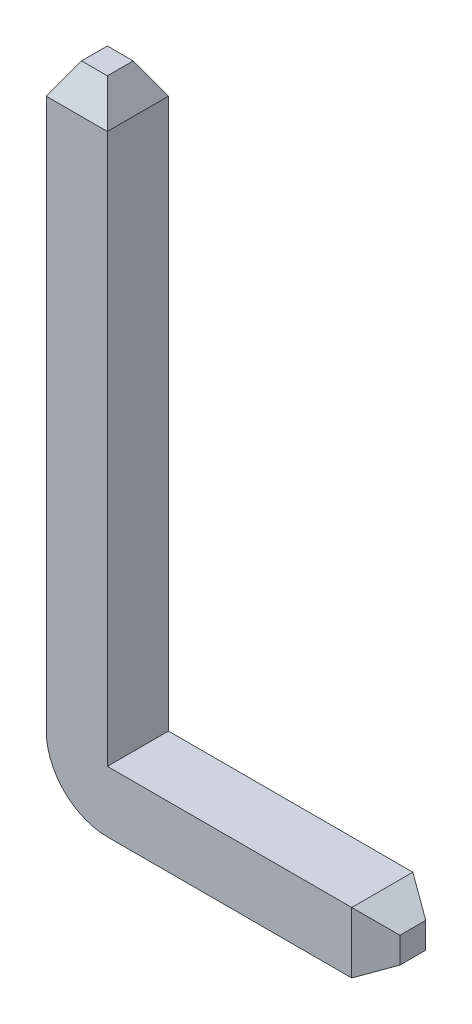
ISO-10303-21;
HEADER;
FILE_DESCRIPTION(('STEP AP214'),'2;1');
FILE_NAME('part.step','',(''),(''),'','','');
FILE_SCHEMA(('AUTOMOTIVE_DESIGN { 1 0 10303 214 1 1 1 1 }'));
ENDSEC;
DATA;
#1=APPLICATION_CONTEXT('core data for automotive mechanical design processes');
#2=APPLICATION_PROTOCOL_DEFINITION('international standard','automotive_design',2000,#1);
#3=PRODUCT_CONTEXT('',#1,'mechanical');
#4=PRODUCT('Part','Part','',(#3));
#5=PRODUCT_RELATED_PRODUCT_CATEGORY('part','',(#4));
#6=PRODUCT_DEFINITION_FORMATION('','',#4);
#7=PRODUCT_DEFINITION_CONTEXT('part definition',#1,'design');
#8=PRODUCT_DEFINITION('design','',#6,#7);
#9=PRODUCT_DEFINITION_SHAPE('','',#8);
#10=(LENGTH_UNIT() NAMED_UNIT(*) SI_UNIT(.MILLI.,.METRE.));
#11=(NAMED_UNIT(*) PLANE_ANGLE_UNIT() SI_UNIT($,.RADIAN.));
#12=(NAMED_UNIT(*) SI_UNIT($,.STERADIAN.) SOLID_ANGLE_UNIT());
#13=UNCERTAINTY_MEASURE_WITH_UNIT(LENGTH_MEASURE(1.E-05),#10,'distance_accuracy_value','');
#14=(GEOMETRIC_REPRESENTATION_CONTEXT(3) GLOBAL_UNCERTAINTY_ASSIGNED_CONTEXT((#13)) GLOBAL_UNIT_ASSIGNED_CONTEXT((#10,
#11,#12)) REPRESENTATION_CONTEXT('',''));
#15=CARTESIAN_POINT('',(0.,0.,0.));
#16=DIRECTION('',(0.,0.,1.));
#17=DIRECTION('',(1.,0.,0.));
#18=AXIS2_PLACEMENT_3D('',#15,#16,#17);
#19=CARTESIAN_POINT('',(0.2,-0.2,0.2));
#20=DIRECTION('',(0.,1.,0.));
#21=DIRECTION('',(0.,0.,1.));
#22=AXIS2_PLACEMENT_3D('',#19,#20,#21);
#23=PLANE('',#22);
#24=DIRECTION('',(1.,0.,0.));
#25=VECTOR('',#24,1.);
#26=CARTESIAN_POINT('',(0.2,-0.2,-0.2));
#27=LINE('',#26,#25);
#28=CARTESIAN_POINT('',(0.2,-0.2,-0.2));
#29=VERTEX_POINT('',#28);
#30=CARTESIAN_POINT('',(1.8,-0.2,-0.2));
#31=VERTEX_POINT('',#30);
#32=EDGE_CURVE('E127',#29,#31,#27,.T.);
#33=ORIENTED_EDGE('',*,*,#32,.T.);
#34=DIRECTION('',(0.,0.,1.));
#35=VECTOR('',#34,1.);
#36=CARTESIAN_POINT('',(1.8,-0.2,0.2));
#37=LINE('',#36,#35);
#38=CARTESIAN_POINT('',(1.8,-0.2,0.2));
#39=VERTEX_POINT('',#38);
#40=EDGE_CURVE('E57',#31,#39,#37,.T.);
#41=ORIENTED_EDGE('',*,*,#40,.T.);
#42=DIRECTION('',(1.,0.,0.));
#43=VECTOR('',#42,1.);
#44=CARTESIAN_POINT('',(0.2,-0.2,0.2));
#45=LINE('',#44,#43);
#46=CARTESIAN_POINT('',(0.2,-0.2,0.2));
#47=VERTEX_POINT('',#46);
#48=EDGE_CURVE('E166',#47,#39,#45,.T.);
#49=ORIENTED_EDGE('',*,*,#48,.F.);
#50=DIRECTION('',(0.,0.,1.));
#51=VECTOR('',#50,1.);
#52=CARTESIAN_POINT('',(0.2,-0.2,0.2));
#53=LINE('',#52,#51);
#54=EDGE_CURVE('E153',#29,#47,#53,.T.);
#55=ORIENTED_EDGE('',*,*,#54,.F.);
#56=EDGE_LOOP('',(#33,#41,#49,#55));
#57=FACE_BOUND('',#56,.T.);
#58=ADVANCED_FACE('F33',(#57),#23,.F.);
#59=CARTESIAN_POINT('',(0.2,0.2,0.2));
#60=DIRECTION('',(0.,-1.,0.));
#61=DIRECTION('',(0.,0.,-1.));
#62=AXIS2_PLACEMENT_3D('',#59,#60,#61);
#63=PLANE('',#62);
#64=DIRECTION('',(1.,0.,0.));
#65=VECTOR('',#64,1.);
#66=CARTESIAN_POINT('',(0.2,0.2,0.2));
#67=LINE('',#66,#65);
#68=CARTESIAN_POINT('',(0.2,0.2,0.2));
#69=VERTEX_POINT('',#68);
#70=CARTESIAN_POINT('',(1.8,0.2,0.2));
#71=VERTEX_POINT('',#70);
#72=EDGE_CURVE('E168',#69,#71,#67,.T.);
#73=ORIENTED_EDGE('',*,*,#72,.T.);
#74=DIRECTION('',(0.,0.,-1.));
#75=VECTOR('',#74,1.);
#76=CARTESIAN_POINT('',(1.8,0.2,-0.2));
#77=LINE('',#76,#75);
#78=CARTESIAN_POINT('',(1.8,0.2,-0.2));
#79=VERTEX_POINT('',#78);
#80=EDGE_CURVE('E11',#71,#79,#77,.T.);
#81=ORIENTED_EDGE('',*,*,#80,.T.);
#82=DIRECTION('',(1.,0.,0.));
#83=VECTOR('',#82,1.);
#84=CARTESIAN_POINT('',(0.2,0.2,-0.2));
#85=LINE('',#84,#83);
#86=CARTESIAN_POINT('',(0.2,0.2,-0.2));
#87=VERTEX_POINT('',#86);
#88=EDGE_CURVE('E117',#87,#79,#85,.T.);
#89=ORIENTED_EDGE('',*,*,#88,.F.);
#90=DIRECTION('',(0.,0.,-1.));
#91=VECTOR('',#90,1.);
#92=CARTESIAN_POINT('',(0.2,0.2,0.2));
#93=LINE('',#92,#91);
#94=EDGE_CURVE('E121',#69,#87,#93,.T.);
#95=ORIENTED_EDGE('',*,*,#94,.F.);
#96=EDGE_LOOP('',(#73,#81,#89,#95));
#97=FACE_BOUND('',#96,.T.);
#98=ADVANCED_FACE('F119',(#97),#63,.F.);
#99=CARTESIAN_POINT('',(0.2,0.2,0.));
#100=DIRECTION('',(0.,0.,1.));
#101=DIRECTION('',(1.,0.,0.));
#102=AXIS2_PLACEMENT_3D('',#99,#100,#101);
#103=CYLINDRICAL_SURFACE('',#102,0.4);
#104=DIRECTION('',(0.,0.,1.));
#105=VECTOR('',#104,1.);
#106=CARTESIAN_POINT('',(-0.2,0.2,0.2));
#107=LINE('',#106,#105);
#108=CARTESIAN_POINT('',(-0.2,0.2,-0.2));
#109=VERTEX_POINT('',#108);
#110=CARTESIAN_POINT('',(-0.2,0.2,0.2));
#111=VERTEX_POINT('',#110);
#112=EDGE_CURVE('E139',#109,#111,#107,.T.);
#113=ORIENTED_EDGE('',*,*,#112,.F.);
#114=CARTESIAN_POINT('',(0.2,0.2,-0.2));
#115=DIRECTION('',(0.,0.,1.));
#116=DIRECTION('',(1.,0.,0.));
#117=AXIS2_PLACEMENT_3D('',#114,#115,#116);
#118=CIRCLE('',#117,0.4);
#119=EDGE_CURVE('E160',#109,#29,#118,.T.);
#120=ORIENTED_EDGE('',*,*,#119,.T.);
#121=ORIENTED_EDGE('',*,*,#54,.T.);
#122=CARTESIAN_POINT('',(0.2,0.2,0.2));
#123=DIRECTION('',(0.,0.,1.));
#124=DIRECTION('',(1.,0.,0.));
#125=AXIS2_PLACEMENT_3D('',#122,#123,#124);
#126=CIRCLE('',#125,0.4);
#127=EDGE_CURVE('E128',#111,#47,#126,.T.);
#128=ORIENTED_EDGE('',*,*,#127,.F.);
#129=EDGE_LOOP('',(#113,#120,#121,#128));
#130=FACE_BOUND('',#129,.T.);
#131=ADVANCED_FACE('F232',(#130),#103,.T.);
#132=CARTESIAN_POINT('',(0.2,0.2,0.2));
#133=DIRECTION('',(1.,0.,0.));
#134=DIRECTION('',(0.,0.,-1.));
#135=AXIS2_PLACEMENT_3D('',#132,#133,#134);
#136=PLANE('',#135);
#137=DIRECTION('',(0.,1.,0.));
#138=VECTOR('',#137,1.);
#139=CARTESIAN_POINT('',(0.2,0.2,-0.2));
#140=LINE('',#139,#138);
#141=CARTESIAN_POINT('',(0.2,3.8,-0.2));
#142=VERTEX_POINT('',#141);
#143=EDGE_CURVE('E131',#87,#142,#140,.T.);
#144=ORIENTED_EDGE('',*,*,#143,.T.);
#145=DIRECTION('',(0.,0.,1.));
#146=VECTOR('',#145,1.);
#147=CARTESIAN_POINT('',(0.2,3.8,0.2));
#148=LINE('',#147,#146);
#149=CARTESIAN_POINT('',(0.2,3.8,0.2));
#150=VERTEX_POINT('',#149);
#151=EDGE_CURVE('E185',#142,#150,#148,.T.);
#152=ORIENTED_EDGE('',*,*,#151,.T.);
#153=DIRECTION('',(0.,1.,0.));
#154=VECTOR('',#153,1.);
#155=CARTESIAN_POINT('',(0.2,0.2,0.2));
#156=LINE('',#155,#154);
#157=EDGE_CURVE('E143',#69,#150,#156,.T.);
#158=ORIENTED_EDGE('',*,*,#157,.F.);
#159=ORIENTED_EDGE('',*,*,#94,.T.);
#160=EDGE_LOOP('',(#144,#152,#158,#159));
#161=FACE_BOUND('',#160,.T.);
#162=ADVANCED_FACE('F141',(#161),#136,.T.);
#163=CARTESIAN_POINT('',(-0.2,0.2,0.2));
#164=DIRECTION('',(0.,0.,1.));
#165=DIRECTION('',(1.,0.,0.));
#166=AXIS2_PLACEMENT_3D('',#163,#164,#165);
#167=PLANE('',#166);
#168=ORIENTED_EDGE('',*,*,#48,.T.);
#169=DIRECTION('',(0.,1.,0.));
#170=VECTOR('',#169,1.);
#171=CARTESIAN_POINT('',(1.8,0.2,0.2));
#172=LINE('',#171,#170);
#173=EDGE_CURVE('E42',#39,#71,#172,.T.);
#174=ORIENTED_EDGE('',*,*,#173,.T.);
#175=ORIENTED_EDGE('',*,*,#72,.F.);
#176=ORIENTED_EDGE('',*,*,#157,.T.);
#177=DIRECTION('',(-1.,0.,0.));
#178=VECTOR('',#177,1.);
#179=CARTESIAN_POINT('',(-0.2,3.8,0.2));
#180=LINE('',#179,#178);
#181=CARTESIAN_POINT('',(-0.2,3.8,0.2));
#182=VERTEX_POINT('',#181);
#183=EDGE_CURVE('E179',#150,#182,#180,.T.);
#184=ORIENTED_EDGE('',*,*,#183,.T.);
#185=DIRECTION('',(0.,1.,0.));
#186=VECTOR('',#185,1.);
#187=CARTESIAN_POINT('',(-0.2,0.2,0.2));
#188=LINE('',#187,#186);
#189=EDGE_CURVE('E154',#111,#182,#188,.T.);
#190=ORIENTED_EDGE('',*,*,#189,.F.);
#191=ORIENTED_EDGE('',*,*,#127,.T.);
#192=EDGE_LOOP('',(#168,#174,#175,#176,#184,#190,#191));
#193=FACE_BOUND('',#192,.T.);
#194=ADVANCED_FACE('F253',(#193),#167,.T.);
#195=CARTESIAN_POINT('',(-0.2,0.2,0.2));
#196=DIRECTION('',(-1.,0.,0.));
#197=DIRECTION('',(0.,0.,1.));
#198=AXIS2_PLACEMENT_3D('',#195,#196,#197);
#199=PLANE('',#198);
#200=ORIENTED_EDGE('',*,*,#189,.T.);
#201=DIRECTION('',(0.,0.,-1.));
#202=VECTOR('',#201,1.);
#203=CARTESIAN_POINT('',(-0.2,3.8,-0.2));
#204=LINE('',#203,#202);
#205=CARTESIAN_POINT('',(-0.2,3.8,-0.2));
#206=VERTEX_POINT('',#205);
#207=EDGE_CURVE('E182',#182,#206,#204,.T.);
#208=ORIENTED_EDGE('',*,*,#207,.T.);
#209=DIRECTION('',(0.,1.,0.));
#210=VECTOR('',#209,1.);
#211=CARTESIAN_POINT('',(-0.2,0.2,-0.2));
#212=LINE('',#211,#210);
#213=EDGE_CURVE('E138',#109,#206,#212,.T.);
#214=ORIENTED_EDGE('',*,*,#213,.F.);
#215=ORIENTED_EDGE('',*,*,#112,.T.);
#216=EDGE_LOOP('',(#200,#208,#214,#215));
#217=FACE_BOUND('',#216,.T.);
#218=ADVANCED_FACE('F277',(#217),#199,.T.);
#219=CARTESIAN_POINT('',(-0.2,0.2,-0.2));
#220=DIRECTION('',(0.,0.,-1.));
#221=DIRECTION('',(-1.,0.,0.));
#222=AXIS2_PLACEMENT_3D('',#219,#220,#221);
#223=PLANE('',#222);
#224=ORIENTED_EDGE('',*,*,#88,.T.);
#225=DIRECTION('',(0.,-1.,0.));
#226=VECTOR('',#225,1.);
#227=CARTESIAN_POINT('',(1.8,0.2,-0.2));
#228=LINE('',#227,#226);
#229=EDGE_CURVE('E187',#79,#31,#228,.T.);
#230=ORIENTED_EDGE('',*,*,#229,.T.);
#231=ORIENTED_EDGE('',*,*,#32,.F.);
#232=ORIENTED_EDGE('',*,*,#119,.F.);
#233=ORIENTED_EDGE('',*,*,#213,.T.);
#234=DIRECTION('',(1.,0.,0.));
#235=VECTOR('',#234,1.);
#236=CARTESIAN_POINT('',(0.2,3.8,-0.2));
#237=LINE('',#236,#235);
#238=EDGE_CURVE('E135',#206,#142,#237,.T.);
#239=ORIENTED_EDGE('',*,*,#238,.T.);
#240=ORIENTED_EDGE('',*,*,#143,.F.);
#241=EDGE_LOOP('',(#224,#230,#231,#232,#233,#239,#240));
#242=FACE_BOUND('',#241,.T.);
#243=ADVANCED_FACE('F132',(#242),#223,.T.);
#244=CARTESIAN_POINT('',(2.,0.,0.));
#245=DIRECTION('',(1.,0.,0.));
#246=DIRECTION('',(0.,0.,-1.));
#247=AXIS2_PLACEMENT_3D('',#244,#245,#246);
#248=PLANE('',#247);
#249=DIRECTION('',(0.,0.,-1.));
#250=VECTOR('',#249,1.);
#251=CARTESIAN_POINT('',(2.,-0.0845299461620743,-0.2));
#252=LINE('',#251,#250);
#253=CARTESIAN_POINT('',(2.,-0.0845299461620743,0.0845299461620743));
#254=VERTEX_POINT('',#253);
#255=CARTESIAN_POINT('',(2.,-0.0845299461620743,-0.0845299461620743));
#256=VERTEX_POINT('',#255);
#257=EDGE_CURVE('E199',#254,#256,#252,.T.);
#258=ORIENTED_EDGE('',*,*,#257,.T.);
#259=DIRECTION('',(0.,1.,0.));
#260=VECTOR('',#259,1.);
#261=CARTESIAN_POINT('',(2.,0.,-0.0845299461620743));
#262=LINE('',#261,#260);
#263=CARTESIAN_POINT('',(2.,0.0845299461620743,-0.0845299461620743));
#264=VERTEX_POINT('',#263);
#265=EDGE_CURVE('E201',#256,#264,#262,.T.);
#266=ORIENTED_EDGE('',*,*,#265,.T.);
#267=DIRECTION('',(0.,0.,1.));
#268=VECTOR('',#267,1.);
#269=CARTESIAN_POINT('',(2.,0.0845299461620743,0.2));
#270=LINE('',#269,#268);
#271=CARTESIAN_POINT('',(2.,0.0845299461620743,0.0845299461620743));
#272=VERTEX_POINT('',#271);
#273=EDGE_CURVE('E195',#264,#272,#270,.T.);
#274=ORIENTED_EDGE('',*,*,#273,.T.);
#275=DIRECTION('',(0.,-1.,0.));
#276=VECTOR('',#275,1.);
#277=CARTESIAN_POINT('',(2.,0.,0.0845299461620743));
#278=LINE('',#277,#276);
#279=EDGE_CURVE('E197',#272,#254,#278,.T.);
#280=ORIENTED_EDGE('',*,*,#279,.T.);
#281=EDGE_LOOP('',(#258,#266,#274,#280));
#282=FACE_BOUND('',#281,.T.);
#283=ADVANCED_FACE('F222',(#282),#248,.T.);
#284=CARTESIAN_POINT('',(0.,4.,0.));
#285=DIRECTION('',(0.,-1.,0.));
#286=DIRECTION('',(0.,0.,-1.));
#287=AXIS2_PLACEMENT_3D('',#284,#285,#286);
#288=PLANE('',#287);
#289=DIRECTION('',(0.,0.,1.));
#290=VECTOR('',#289,1.);
#291=CARTESIAN_POINT('',(-0.0845299461620739,4.,0.2));
#292=LINE('',#291,#290);
#293=CARTESIAN_POINT('',(-0.0845299461620739,4.,-0.0845299461620738));
#294=VERTEX_POINT('',#293);
#295=CARTESIAN_POINT('',(-0.0845299461620739,4.,0.0845299461620738));
#296=VERTEX_POINT('',#295);
#297=EDGE_CURVE('E174',#294,#296,#292,.T.);
#298=ORIENTED_EDGE('',*,*,#297,.T.);
#299=DIRECTION('',(1.,0.,0.));
#300=VECTOR('',#299,1.);
#301=CARTESIAN_POINT('',(0.2,4.,0.0845299461620738));
#302=LINE('',#301,#300);
#303=CARTESIAN_POINT('',(0.0845299461620738,4.,0.0845299461620738));
#304=VERTEX_POINT('',#303);
#305=EDGE_CURVE('E176',#296,#304,#302,.T.);
#306=ORIENTED_EDGE('',*,*,#305,.T.);
#307=DIRECTION('',(0.,0.,-1.));
#308=VECTOR('',#307,1.);
#309=CARTESIAN_POINT('',(0.0845299461620738,4.,-0.2));
#310=LINE('',#309,#308);
#311=CARTESIAN_POINT('',(0.0845299461620738,4.,-0.0845299461620738));
#312=VERTEX_POINT('',#311);
#313=EDGE_CURVE('E170',#304,#312,#310,.T.);
#314=ORIENTED_EDGE('',*,*,#313,.T.);
#315=DIRECTION('',(-1.,0.,0.));
#316=VECTOR('',#315,1.);
#317=CARTESIAN_POINT('',(-0.2,4.,-0.0845299461620738));
#318=LINE('',#317,#316);
#319=EDGE_CURVE('E172',#312,#294,#318,.T.);
#320=ORIENTED_EDGE('',*,*,#319,.T.);
#321=EDGE_LOOP('',(#298,#306,#314,#320));
#322=FACE_BOUND('',#321,.T.);
#323=ADVANCED_FACE('F247',(#322),#288,.F.);
#324=CARTESIAN_POINT('',(0.,4.,-0.0845299461620738));
#325=DIRECTION('',(0.,0.5,-0.866025403784439));
#326=DIRECTION('',(1.,0.,0.));
#327=AXIS2_PLACEMENT_3D('',#324,#325,#326);
#328=PLANE('',#327);
#329=DIRECTION('',(-0.447213595499958,0.774596669241483,0.447213595499958));
#330=VECTOR('',#329,1.);
#331=CARTESIAN_POINT('',(0.067623956929659,4.02928203230275,-0.0676239569296591));
#332=LINE('',#331,#330);
#333=EDGE_CURVE('E149',#142,#312,#332,.T.);
#334=ORIENTED_EDGE('',*,*,#333,.F.);
#335=ORIENTED_EDGE('',*,*,#238,.F.);
#336=DIRECTION('',(0.447213595499958,0.774596669241483,0.447213595499958));
#337=VECTOR('',#336,1.);
#338=CARTESIAN_POINT('',(-0.0676239569296591,4.02928203230275,-0.0676239569296591));
#339=LINE('',#338,#337);
#340=EDGE_CURVE('E144',#294,#206,#339,.F.);
#341=ORIENTED_EDGE('',*,*,#340,.F.);
#342=ORIENTED_EDGE('',*,*,#319,.F.);
#343=EDGE_LOOP('',(#334,#335,#341,#342));
#344=FACE_BOUND('',#343,.T.);
#345=ADVANCED_FACE('F237',(#344),#328,.T.);
#346=CARTESIAN_POINT('',(-0.0845299461620739,4.,0.));
#347=DIRECTION('',(-0.866025403784439,0.5,0.));
#348=DIRECTION('',(0.,0.,-1.));
#349=AXIS2_PLACEMENT_3D('',#346,#347,#348);
#350=PLANE('',#349);
#351=ORIENTED_EDGE('',*,*,#340,.T.);
#352=ORIENTED_EDGE('',*,*,#207,.F.);
#353=DIRECTION('',(0.447213595499958,0.774596669241483,-0.447213595499958));
#354=VECTOR('',#353,1.);
#355=CARTESIAN_POINT('',(-0.0676239569296591,4.02928203230275,0.0676239569296591));
#356=LINE('',#355,#354);
#357=EDGE_CURVE('E190',#296,#182,#356,.F.);
#358=ORIENTED_EDGE('',*,*,#357,.F.);
#359=ORIENTED_EDGE('',*,*,#297,.F.);
#360=EDGE_LOOP('',(#351,#352,#358,#359));
#361=FACE_BOUND('',#360,.T.);
#362=ADVANCED_FACE('F243',(#361),#350,.T.);
#363=CARTESIAN_POINT('',(0.0845299461620738,4.,0.));
#364=DIRECTION('',(0.866025403784439,0.5,0.));
#365=DIRECTION('',(0.,0.,1.));
#366=AXIS2_PLACEMENT_3D('',#363,#364,#365);
#367=PLANE('',#366);
#368=ORIENTED_EDGE('',*,*,#333,.T.);
#369=ORIENTED_EDGE('',*,*,#313,.F.);
#370=DIRECTION('',(0.447213595499958,-0.774596669241483,0.447213595499958));
#371=VECTOR('',#370,1.);
#372=CARTESIAN_POINT('',(0.067623956929659,4.02928203230275,0.0676239569296591));
#373=LINE('',#372,#371);
#374=EDGE_CURVE('E188',#150,#304,#373,.F.);
#375=ORIENTED_EDGE('',*,*,#374,.F.);
#376=ORIENTED_EDGE('',*,*,#151,.F.);
#377=EDGE_LOOP('',(#368,#369,#375,#376));
#378=FACE_BOUND('',#377,.T.);
#379=ADVANCED_FACE('F250',(#378),#367,.T.);
#380=CARTESIAN_POINT('',(0.,4.,0.0845299461620738));
#381=DIRECTION('',(0.,0.5,0.866025403784439));
#382=DIRECTION('',(-1.,0.,0.));
#383=AXIS2_PLACEMENT_3D('',#380,#381,#382);
#384=PLANE('',#383);
#385=ORIENTED_EDGE('',*,*,#357,.T.);
#386=ORIENTED_EDGE('',*,*,#183,.F.);
#387=ORIENTED_EDGE('',*,*,#374,.T.);
#388=ORIENTED_EDGE('',*,*,#305,.F.);
#389=EDGE_LOOP('',(#385,#386,#387,#388));
#390=FACE_BOUND('',#389,.T.);
#391=ADVANCED_FACE('F256',(#390),#384,.T.);
#392=CARTESIAN_POINT('',(1.8,0.2,0.2));
#393=DIRECTION('',(-0.499999999999998,0.,-0.86602540378444));
#394=DIRECTION('',(0.,1.,0.));
#395=AXIS2_PLACEMENT_3D('',#392,#393,#394);
#396=PLANE('',#395);
#397=DIRECTION('',(-0.774596669241485,-0.447213595499956,0.447213595499956));
#398=VECTOR('',#397,1.);
#399=CARTESIAN_POINT('',(1.93856406460551,-0.120000000000001,0.120000000000001));
#400=LINE('',#399,#398);
#401=EDGE_CURVE('E209',#254,#39,#400,.T.);
#402=ORIENTED_EDGE('',*,*,#401,.F.);
#403=ORIENTED_EDGE('',*,*,#279,.F.);
#404=DIRECTION('',(-0.774596669241485,0.447213595499956,0.447213595499956));
#405=VECTOR('',#404,1.);
#406=CARTESIAN_POINT('',(1.8,0.2,0.2));
#407=LINE('',#406,#405);
#408=EDGE_CURVE('E37',#71,#272,#407,.F.);
#409=ORIENTED_EDGE('',*,*,#408,.F.);
#410=ORIENTED_EDGE('',*,*,#173,.F.);
#411=EDGE_LOOP('',(#402,#403,#409,#410));
#412=FACE_BOUND('',#411,.T.);
#413=ADVANCED_FACE('F35',(#412),#396,.F.);
#414=CARTESIAN_POINT('',(1.8,0.2,0.2));
#415=DIRECTION('',(0.499999999999998,0.86602540378444,0.));
#416=DIRECTION('',(0.,0.,1.));
#417=AXIS2_PLACEMENT_3D('',#414,#415,#416);
#418=PLANE('',#417);
#419=ORIENTED_EDGE('',*,*,#408,.T.);
#420=ORIENTED_EDGE('',*,*,#273,.F.);
#421=DIRECTION('',(0.774596669241485,-0.447213595499956,0.447213595499956));
#422=VECTOR('',#421,1.);
#423=CARTESIAN_POINT('',(1.93856406460551,0.120000000000001,-0.120000000000001));
#424=LINE('',#423,#422);
#425=EDGE_CURVE('E208',#79,#264,#424,.T.);
#426=ORIENTED_EDGE('',*,*,#425,.F.);
#427=ORIENTED_EDGE('',*,*,#80,.F.);
#428=EDGE_LOOP('',(#419,#420,#426,#427));
#429=FACE_BOUND('',#428,.T.);
#430=ADVANCED_FACE('F218',(#429),#418,.T.);
#431=CARTESIAN_POINT('',(1.8,-0.2,0.2));
#432=DIRECTION('',(0.499999999999998,-0.86602540378444,0.));
#433=DIRECTION('',(0.,0.,-1.));
#434=AXIS2_PLACEMENT_3D('',#431,#432,#433);
#435=PLANE('',#434);
#436=ORIENTED_EDGE('',*,*,#401,.T.);
#437=ORIENTED_EDGE('',*,*,#40,.F.);
#438=DIRECTION('',(-0.774596669241485,-0.447213595499956,-0.447213595499956));
#439=VECTOR('',#438,1.);
#440=CARTESIAN_POINT('',(1.93856406460551,-0.120000000000001,-0.120000000000001));
#441=LINE('',#440,#439);
#442=EDGE_CURVE('E206',#256,#31,#441,.T.);
#443=ORIENTED_EDGE('',*,*,#442,.F.);
#444=ORIENTED_EDGE('',*,*,#257,.F.);
#445=EDGE_LOOP('',(#436,#437,#443,#444));
#446=FACE_BOUND('',#445,.T.);
#447=ADVANCED_FACE('F228',(#446),#435,.T.);
#448=CARTESIAN_POINT('',(1.8,0.2,-0.2));
#449=DIRECTION('',(-0.499999999999998,0.,0.86602540378444));
#450=DIRECTION('',(0.,-1.,0.));
#451=AXIS2_PLACEMENT_3D('',#448,#449,#450);
#452=PLANE('',#451);
#453=ORIENTED_EDGE('',*,*,#425,.T.);
#454=ORIENTED_EDGE('',*,*,#265,.F.);
#455=ORIENTED_EDGE('',*,*,#442,.T.);
#456=ORIENTED_EDGE('',*,*,#229,.F.);
#457=EDGE_LOOP('',(#453,#454,#455,#456));
#458=FACE_BOUND('',#457,.T.);
#459=ADVANCED_FACE('F226',(#458),#452,.F.);
#460=CLOSED_SHELL('',(#58,#98,#131,#162,#194,#218,#243,#283,#323,#345,#362,#379,#391,#413,#430,
#447,#459));
#461=MANIFOLD_SOLID_BREP('B2',#460);
#462=ADVANCED_BREP_SHAPE_REPRESENTATION('',(#18,#461),#14);
#463=SHAPE_DEFINITION_REPRESENTATION(#9,#462);
ENDSEC;
END-ISO-10303-21;
